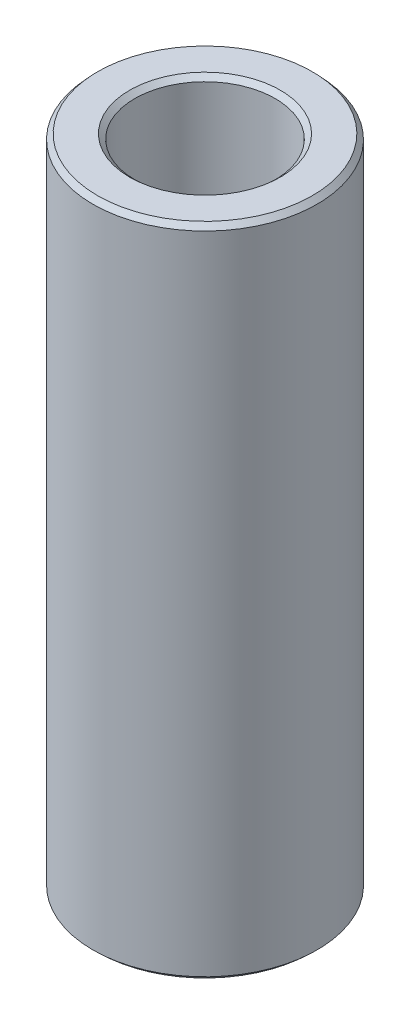
ISO-10303-21;
HEADER;
FILE_DESCRIPTION(('STEP AP214'),'2;1');
FILE_NAME('part.step','',(''),(''),'','','');
FILE_SCHEMA(('AUTOMOTIVE_DESIGN { 1 0 10303 214 1 1 1 1 }'));
ENDSEC;
DATA;
#1=APPLICATION_CONTEXT('core data for automotive mechanical design processes');
#2=APPLICATION_PROTOCOL_DEFINITION('international standard','automotive_design',2000,#1);
#3=PRODUCT_CONTEXT('',#1,'mechanical');
#4=PRODUCT('Part','Part','',(#3));
#5=PRODUCT_RELATED_PRODUCT_CATEGORY('part','',(#4));
#6=PRODUCT_DEFINITION_FORMATION('','',#4);
#7=PRODUCT_DEFINITION_CONTEXT('part definition',#1,'design');
#8=PRODUCT_DEFINITION('design','',#6,#7);
#9=PRODUCT_DEFINITION_SHAPE('','',#8);
#10=(LENGTH_UNIT() NAMED_UNIT(*) SI_UNIT(.MILLI.,.METRE.));
#11=(NAMED_UNIT(*) PLANE_ANGLE_UNIT() SI_UNIT($,.RADIAN.));
#12=(NAMED_UNIT(*) SI_UNIT($,.STERADIAN.) SOLID_ANGLE_UNIT());
#13=UNCERTAINTY_MEASURE_WITH_UNIT(LENGTH_MEASURE(1.E-05),#10,'distance_accuracy_value','');
#14=(GEOMETRIC_REPRESENTATION_CONTEXT(3) GLOBAL_UNCERTAINTY_ASSIGNED_CONTEXT((#13)) GLOBAL_UNIT_ASSIGNED_CONTEXT((#10,
#11,#12)) REPRESENTATION_CONTEXT('',''));
#15=CARTESIAN_POINT('',(0.,0.,0.));
#16=DIRECTION('',(0.,0.,1.));
#17=DIRECTION('',(1.,0.,0.));
#18=AXIS2_PLACEMENT_3D('',#15,#16,#17);
#19=CARTESIAN_POINT('',(0.,116.987835011829,0.));
#20=DIRECTION('',(0.,-1.,0.));
#21=DIRECTION('',(0.,0.,-1.));
#22=AXIS2_PLACEMENT_3D('',#19,#20,#21);
#23=CYLINDRICAL_SURFACE('',#22,20.);
#24=CARTESIAN_POINT('',(0.,0.836514020417498,0.));
#25=DIRECTION('',(0.,1.,0.));
#26=DIRECTION('',(0.,0.,1.));
#27=AXIS2_PLACEMENT_3D('',#24,#25,#26);
#28=CIRCLE('',#27,20.);
#29=CARTESIAN_POINT('',(0.,0.836514020417498,20.));
#30=VERTEX_POINT('',#29);
#31=EDGE_CURVE('E10',#30,#30,#28,.T.);
#32=ORIENTED_EDGE('',*,*,#31,.T.);
#33=EDGE_LOOP('',(#32));
#34=FACE_BOUND('',#33,.T.);
#35=CARTESIAN_POINT('',(0.,116.078143072328,0.));
#36=DIRECTION('',(0.,1.,0.));
#37=DIRECTION('',(0.,0.,1.));
#38=AXIS2_PLACEMENT_3D('',#35,#36,#37);
#39=CIRCLE('',#38,20.);
#40=CARTESIAN_POINT('',(0.,116.078143072328,20.));
#41=VERTEX_POINT('',#40);
#42=EDGE_CURVE('E50',#41,#41,#39,.F.);
#43=ORIENTED_EDGE('',*,*,#42,.T.);
#44=EDGE_LOOP('',(#43));
#45=FACE_BOUND('',#44,.T.);
#46=ADVANCED_FACE('F39',(#34,#45),#23,.T.);
#47=CARTESIAN_POINT('',(0.,116.987835011829,0.));
#48=DIRECTION('',(0.,1.,0.));
#49=DIRECTION('',(0.,0.,1.));
#50=AXIS2_PLACEMENT_3D('',#47,#48,#49);
#51=PLANE('',#50);
#52=CARTESIAN_POINT('',(0.,116.987835011829,0.));
#53=DIRECTION('',(0.,1.,0.));
#54=DIRECTION('',(0.,0.,1.));
#55=AXIS2_PLACEMENT_3D('',#52,#53,#54);
#56=CIRCLE('',#55,13.4484659419492);
#57=CARTESIAN_POINT('',(0.,116.987835011829,13.4484659419492));
#58=VERTEX_POINT('',#57);
#59=EDGE_CURVE('E58',#58,#58,#56,.F.);
#60=ORIENTED_EDGE('',*,*,#59,.T.);
#61=EDGE_LOOP('',(#60));
#62=FACE_BOUND('',#61,.T.);
#63=CARTESIAN_POINT('',(0.,116.987835011829,0.));
#64=DIRECTION('',(0.,1.,0.));
#65=DIRECTION('',(0.,0.,1.));
#66=AXIS2_PLACEMENT_3D('',#63,#64,#65);
#67=CIRCLE('',#66,19.1634859795825);
#68=CARTESIAN_POINT('',(0.,116.987835011829,19.1634859795825));
#69=VERTEX_POINT('',#68);
#70=EDGE_CURVE('E61',#69,#69,#67,.T.);
#71=ORIENTED_EDGE('',*,*,#70,.T.);
#72=EDGE_LOOP('',(#71));
#73=FACE_BOUND('',#72,.T.);
#74=ADVANCED_FACE('F88',(#62,#73),#51,.T.);
#75=CARTESIAN_POINT('',(0.,0.,0.));
#76=DIRECTION('',(0.,1.,0.));
#77=DIRECTION('',(0.,0.,1.));
#78=AXIS2_PLACEMENT_3D('',#75,#76,#77);
#79=PLANE('',#78);
#80=CARTESIAN_POINT('',(0.,0.,0.));
#81=DIRECTION('',(0.,1.,0.));
#82=DIRECTION('',(0.,0.,1.));
#83=AXIS2_PLACEMENT_3D('',#80,#81,#82);
#84=CIRCLE('',#83,13.3752880228664);
#85=CARTESIAN_POINT('',(0.,0.,13.3752880228664));
#86=VERTEX_POINT('',#85);
#87=EDGE_CURVE('E51',#86,#86,#84,.T.);
#88=ORIENTED_EDGE('',*,*,#87,.T.);
#89=EDGE_LOOP('',(#88));
#90=FACE_BOUND('',#89,.T.);
#91=CARTESIAN_POINT('',(0.,0.,0.));
#92=DIRECTION('',(0.,1.,0.));
#93=DIRECTION('',(0.,0.,1.));
#94=AXIS2_PLACEMENT_3D('',#91,#92,#93);
#95=CIRCLE('',#94,19.0903080604998);
#96=CARTESIAN_POINT('',(0.,0.,19.0903080604998));
#97=VERTEX_POINT('',#96);
#98=EDGE_CURVE('E54',#97,#97,#95,.F.);
#99=ORIENTED_EDGE('',*,*,#98,.T.);
#100=EDGE_LOOP('',(#99));
#101=FACE_BOUND('',#100,.T.);
#102=ADVANCED_FACE('F83',(#90,#101),#79,.F.);
#103=CARTESIAN_POINT('',(0.,116.987835011829,0.));
#104=DIRECTION('',(0.,-1.,0.));
#105=DIRECTION('',(0.,0.,-1.));
#106=AXIS2_PLACEMENT_3D('',#103,#104,#105);
#107=CYLINDRICAL_SURFACE('',#106,12.5387740024489);
#108=CARTESIAN_POINT('',(0.,116.151320991411,0.));
#109=DIRECTION('',(0.,1.,0.));
#110=DIRECTION('',(0.,0.,1.));
#111=AXIS2_PLACEMENT_3D('',#108,#109,#110);
#112=CIRCLE('',#111,12.5387740024489);
#113=CARTESIAN_POINT('',(0.,116.151320991411,12.5387740024489));
#114=VERTEX_POINT('',#113);
#115=EDGE_CURVE('E67',#114,#114,#112,.T.);
#116=ORIENTED_EDGE('',*,*,#115,.T.);
#117=EDGE_LOOP('',(#116));
#118=FACE_BOUND('',#117,.T.);
#119=CARTESIAN_POINT('',(0.,0.909691939500148,0.));
#120=DIRECTION('',(0.,1.,0.));
#121=DIRECTION('',(0.,0.,1.));
#122=AXIS2_PLACEMENT_3D('',#119,#120,#121);
#123=CIRCLE('',#122,12.5387740024489);
#124=CARTESIAN_POINT('',(0.,0.909691939500148,12.5387740024489));
#125=VERTEX_POINT('',#124);
#126=EDGE_CURVE('E69',#125,#125,#123,.F.);
#127=ORIENTED_EDGE('',*,*,#126,.T.);
#128=EDGE_LOOP('',(#127));
#129=FACE_BOUND('',#128,.T.);
#130=ADVANCED_FACE('F71',(#118,#129),#107,.F.);
#131=CARTESIAN_POINT('',(0.,116.151320991411,0.));
#132=DIRECTION('',(0.,1.,0.));
#133=DIRECTION('',(0.,0.,1.));
#134=AXIS2_PLACEMENT_3D('',#131,#132,#133);
#135=CONICAL_SURFACE('',#134,12.5387740024489,0.827280465922199);
#136=ORIENTED_EDGE('',*,*,#59,.F.);
#137=EDGE_LOOP('',(#136));
#138=FACE_BOUND('',#137,.T.);
#139=ORIENTED_EDGE('',*,*,#115,.F.);
#140=EDGE_LOOP('',(#139));
#141=FACE_BOUND('',#140,.T.);
#142=ADVANCED_FACE('F77',(#138,#141),#135,.F.);
#143=CARTESIAN_POINT('',(0.,0.,0.));
#144=DIRECTION('',(0.,-1.,0.));
#145=DIRECTION('',(0.,0.,-1.));
#146=AXIS2_PLACEMENT_3D('',#143,#144,#145);
#147=CONICAL_SURFACE('',#146,13.3752880228664,0.743515860872694);
#148=ORIENTED_EDGE('',*,*,#126,.F.);
#149=EDGE_LOOP('',(#148));
#150=FACE_BOUND('',#149,.T.);
#151=ORIENTED_EDGE('',*,*,#87,.F.);
#152=EDGE_LOOP('',(#151));
#153=FACE_BOUND('',#152,.T.);
#154=ADVANCED_FACE('F73',(#150,#153),#147,.F.);
#155=CARTESIAN_POINT('',(0.,0.836514020417498,0.));
#156=DIRECTION('',(0.,1.,0.));
#157=DIRECTION('',(0.,0.,1.));
#158=AXIS2_PLACEMENT_3D('',#155,#156,#157);
#159=CONICAL_SURFACE('',#158,20.,0.827280465922215);
#160=ORIENTED_EDGE('',*,*,#98,.F.);
#161=EDGE_LOOP('',(#160));
#162=FACE_BOUND('',#161,.T.);
#163=ORIENTED_EDGE('',*,*,#31,.F.);
#164=EDGE_LOOP('',(#163));
#165=FACE_BOUND('',#164,.T.);
#166=ADVANCED_FACE('F76',(#162,#165),#159,.T.);
#167=CARTESIAN_POINT('',(0.,116.987835011829,0.));
#168=DIRECTION('',(0.,-1.,0.));
#169=DIRECTION('',(0.,0.,-1.));
#170=AXIS2_PLACEMENT_3D('',#167,#168,#169);
#171=CONICAL_SURFACE('',#170,19.1634859795825,0.743515860872708);
#172=ORIENTED_EDGE('',*,*,#42,.F.);
#173=EDGE_LOOP('',(#172));
#174=FACE_BOUND('',#173,.T.);
#175=ORIENTED_EDGE('',*,*,#70,.F.);
#176=EDGE_LOOP('',(#175));
#177=FACE_BOUND('',#176,.T.);
#178=ADVANCED_FACE('F45',(#174,#177),#171,.T.);
#179=CLOSED_SHELL('',(#46,#74,#102,#130,#142,#154,#166,#178));
#180=MANIFOLD_SOLID_BREP('B2',#179);
#181=ADVANCED_BREP_SHAPE_REPRESENTATION('',(#18,#180),#14);
#182=SHAPE_DEFINITION_REPRESENTATION(#9,#181);
ENDSEC;
END-ISO-10303-21;
